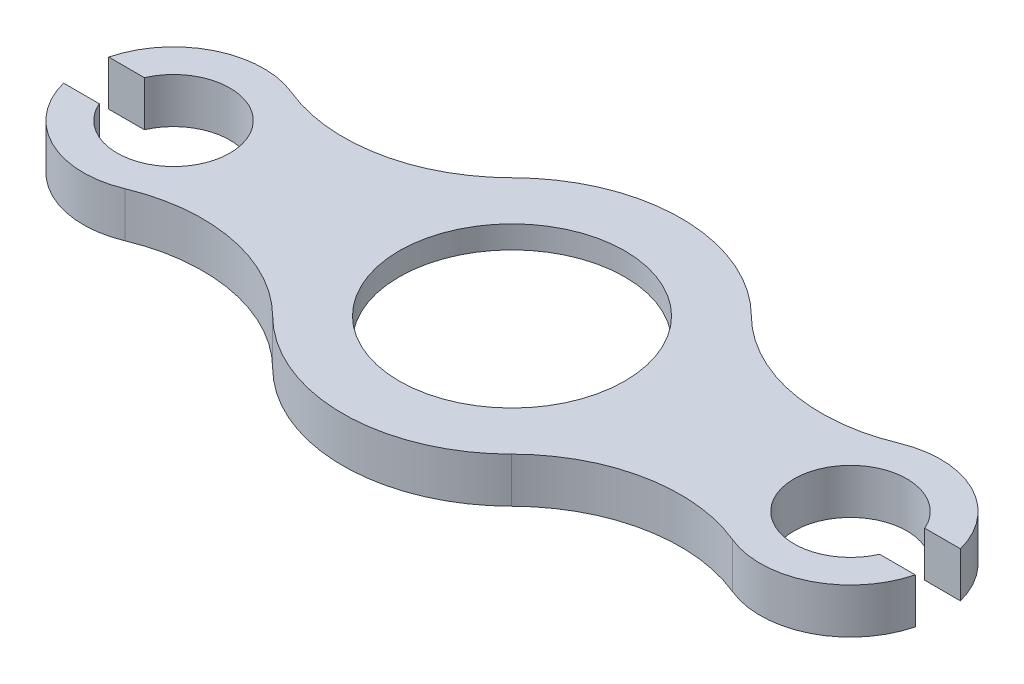
ISO-10303-21;
HEADER;
FILE_DESCRIPTION(('STEP AP214'),'2;1');
FILE_NAME('part.step','',(''),(''),'','','');
FILE_SCHEMA(('AUTOMOTIVE_DESIGN { 1 0 10303 214 1 1 1 1 }'));
ENDSEC;
DATA;
#1=APPLICATION_CONTEXT('core data for automotive mechanical design processes');
#2=APPLICATION_PROTOCOL_DEFINITION('international standard','automotive_design',2000,#1);
#3=PRODUCT_CONTEXT('',#1,'mechanical');
#4=PRODUCT('Part','Part','',(#3));
#5=PRODUCT_RELATED_PRODUCT_CATEGORY('part','',(#4));
#6=PRODUCT_DEFINITION_FORMATION('','',#4);
#7=PRODUCT_DEFINITION_CONTEXT('part definition',#1,'design');
#8=PRODUCT_DEFINITION('design','',#6,#7);
#9=PRODUCT_DEFINITION_SHAPE('','',#8);
#10=(LENGTH_UNIT() NAMED_UNIT(*) SI_UNIT(.MILLI.,.METRE.));
#11=(NAMED_UNIT(*) PLANE_ANGLE_UNIT() SI_UNIT($,.RADIAN.));
#12=(NAMED_UNIT(*) SI_UNIT($,.STERADIAN.) SOLID_ANGLE_UNIT());
#13=UNCERTAINTY_MEASURE_WITH_UNIT(LENGTH_MEASURE(1.E-05),#10,'distance_accuracy_value','');
#14=(GEOMETRIC_REPRESENTATION_CONTEXT(3) GLOBAL_UNCERTAINTY_ASSIGNED_CONTEXT((#13)) GLOBAL_UNIT_ASSIGNED_CONTEXT((#10,
#11,#12)) REPRESENTATION_CONTEXT('',''));
#15=CARTESIAN_POINT('',(0.,0.,0.));
#16=DIRECTION('',(0.,0.,1.));
#17=DIRECTION('',(1.,0.,0.));
#18=AXIS2_PLACEMENT_3D('',#15,#16,#17);
#19=CARTESIAN_POINT('',(17.3076923076924,0.,36.1336032388664));
#20=DIRECTION('',(0.,1.,0.));
#21=DIRECTION('',(0.,0.,1.));
#22=AXIS2_PLACEMENT_3D('',#19,#20,#21);
#23=CYLINDRICAL_SURFACE('',#22,50.);
#24=CARTESIAN_POINT('',(17.3076923076924,20.,36.1336032388664));
#25=DIRECTION('',(0.,1.,0.));
#26=DIRECTION('',(0.,0.,1.));
#27=AXIS2_PLACEMENT_3D('',#24,#25,#26);
#28=CIRCLE('',#27,50.);
#29=CARTESIAN_POINT('',(17.3076923076924,20.,86.1336032388664));
#30=VERTEX_POINT('',#29);
#31=EDGE_CURVE('E211',#30,#30,#28,.T.);
#32=ORIENTED_EDGE('',*,*,#31,.T.);
#33=EDGE_LOOP('',(#32));
#34=FACE_BOUND('',#33,.T.);
#35=CARTESIAN_POINT('',(17.3076923076924,10.,36.1336032388664));
#36=DIRECTION('',(0.,-1.,0.));
#37=DIRECTION('',(0.,0.,-1.));
#38=AXIS2_PLACEMENT_3D('',#35,#36,#37);
#39=CIRCLE('',#38,50.);
#40=CARTESIAN_POINT('',(17.3076923076924,10.,-13.8663967611337));
#41=VERTEX_POINT('',#40);
#42=EDGE_CURVE('E99',#41,#41,#39,.F.);
#43=ORIENTED_EDGE('',*,*,#42,.F.);
#44=EDGE_LOOP('',(#43));
#45=FACE_BOUND('',#44,.T.);
#46=ADVANCED_FACE('F95',(#34,#45),#23,.F.);
#47=CARTESIAN_POINT('',(-132.692307692308,20.,36.1336032388664));
#48=DIRECTION('',(0.,-1.,0.));
#49=DIRECTION('',(0.,0.,-1.));
#50=AXIS2_PLACEMENT_3D('',#47,#48,#49);
#51=CYLINDRICAL_SURFACE('',#50,40.);
#52=CARTESIAN_POINT('',(-132.692307692308,0.,36.1336032388664));
#53=DIRECTION('',(0.,1.,0.));
#54=DIRECTION('',(0.,0.,1.));
#55=AXIS2_PLACEMENT_3D('',#52,#53,#54);
#56=CIRCLE('',#55,40.);
#57=CARTESIAN_POINT('',(-171.422141154382,0.,46.1336032388664));
#58=VERTEX_POINT('',#57);
#59=CARTESIAN_POINT('',(-117.358974358974,0.,73.0780059121928));
#60=VERTEX_POINT('',#59);
#61=EDGE_CURVE('E336',#58,#60,#56,.T.);
#62=ORIENTED_EDGE('',*,*,#61,.T.);
#63=DIRECTION('',(0.,-1.,0.));
#64=VECTOR('',#63,1.);
#65=CARTESIAN_POINT('',(-117.358974358974,20.,73.0780059121928));
#66=LINE('',#65,#64);
#67=CARTESIAN_POINT('',(-117.358974358974,20.,73.0780059121928));
#68=VERTEX_POINT('',#67);
#69=EDGE_CURVE('E106',#68,#60,#66,.T.);
#70=ORIENTED_EDGE('',*,*,#69,.F.);
#71=CARTESIAN_POINT('',(-132.692307692308,20.,36.1336032388664));
#72=DIRECTION('',(0.,1.,0.));
#73=DIRECTION('',(0.,0.,1.));
#74=AXIS2_PLACEMENT_3D('',#71,#72,#73);
#75=CIRCLE('',#74,40.);
#76=CARTESIAN_POINT('',(-171.422141154382,20.,46.1336032388664));
#77=VERTEX_POINT('',#76);
#78=EDGE_CURVE('E399',#77,#68,#75,.T.);
#79=ORIENTED_EDGE('',*,*,#78,.F.);
#80=DIRECTION('',(0.,-1.,0.));
#81=VECTOR('',#80,1.);
#82=CARTESIAN_POINT('',(-171.422141154382,20.,46.1336032388664));
#83=LINE('',#82,#81);
#84=EDGE_CURVE('E12',#77,#58,#83,.T.);
#85=ORIENTED_EDGE('',*,*,#84,.T.);
#86=EDGE_LOOP('',(#62,#70,#79,#85));
#87=FACE_BOUND('',#86,.T.);
#88=ADVANCED_FACE('F425',(#87),#51,.T.);
#89=CARTESIAN_POINT('',(-88.6089743589743,20.,142.34876092468));
#90=DIRECTION('',(0.,-1.,0.));
#91=DIRECTION('',(0.,0.,-1.));
#92=AXIS2_PLACEMENT_3D('',#89,#90,#91);
#93=CYLINDRICAL_SURFACE('',#92,75.);
#94=CARTESIAN_POINT('',(-88.6089743589743,0.,142.34876092468));
#95=DIRECTION('',(0.,1.,0.));
#96=DIRECTION('',(0.,0.,1.));
#97=AXIS2_PLACEMENT_3D('',#94,#95,#96);
#98=CIRCLE('',#97,75.);
#99=CARTESIAN_POINT('',(-35.650641025641,0.,89.2411820817731));
#100=VERTEX_POINT('',#99);
#101=EDGE_CURVE('E340',#100,#60,#98,.T.);
#102=ORIENTED_EDGE('',*,*,#101,.F.);
#103=DIRECTION('',(0.,-1.,0.));
#104=VECTOR('',#103,1.);
#105=CARTESIAN_POINT('',(-35.650641025641,20.,89.2411820817731));
#106=LINE('',#105,#104);
#107=CARTESIAN_POINT('',(-35.650641025641,20.,89.2411820817731));
#108=VERTEX_POINT('',#107);
#109=EDGE_CURVE('E204',#108,#100,#106,.T.);
#110=ORIENTED_EDGE('',*,*,#109,.F.);
#111=CARTESIAN_POINT('',(-88.6089743589743,20.,142.34876092468));
#112=DIRECTION('',(0.,1.,0.));
#113=DIRECTION('',(0.,0.,1.));
#114=AXIS2_PLACEMENT_3D('',#111,#112,#113);
#115=CIRCLE('',#114,75.);
#116=EDGE_CURVE('E289',#108,#68,#115,.T.);
#117=ORIENTED_EDGE('',*,*,#116,.T.);
#118=ORIENTED_EDGE('',*,*,#69,.T.);
#119=EDGE_LOOP('',(#102,#110,#117,#118));
#120=FACE_BOUND('',#119,.T.);
#121=ADVANCED_FACE('F431',(#120),#93,.F.);
#122=CARTESIAN_POINT('',(-88.6089743589743,20.,-70.0815544469471));
#123=DIRECTION('',(0.,-1.,0.));
#124=DIRECTION('',(0.,0.,-1.));
#125=AXIS2_PLACEMENT_3D('',#122,#123,#124);
#126=CYLINDRICAL_SURFACE('',#125,75.);
#127=CARTESIAN_POINT('',(-88.6089743589743,0.,-70.0815544469471));
#128=DIRECTION('',(0.,1.,0.));
#129=DIRECTION('',(0.,0.,1.));
#130=AXIS2_PLACEMENT_3D('',#127,#128,#129);
#131=CIRCLE('',#130,75.);
#132=CARTESIAN_POINT('',(-117.358974358974,0.,-0.810799434460045));
#133=VERTEX_POINT('',#132);
#134=CARTESIAN_POINT('',(-35.650641025641,0.,-16.9739756040404));
#135=VERTEX_POINT('',#134);
#136=EDGE_CURVE('E343',#133,#135,#131,.T.);
#137=ORIENTED_EDGE('',*,*,#136,.F.);
#138=DIRECTION('',(0.,-1.,0.));
#139=VECTOR('',#138,1.);
#140=CARTESIAN_POINT('',(-117.358974358974,20.,-0.810799434460045));
#141=LINE('',#140,#139);
#142=CARTESIAN_POINT('',(-117.358974358974,20.,-0.810799434460045));
#143=VERTEX_POINT('',#142);
#144=EDGE_CURVE('E323',#143,#133,#141,.T.);
#145=ORIENTED_EDGE('',*,*,#144,.F.);
#146=CARTESIAN_POINT('',(-88.6089743589743,20.,-70.0815544469471));
#147=DIRECTION('',(0.,1.,0.));
#148=DIRECTION('',(0.,0.,1.));
#149=AXIS2_PLACEMENT_3D('',#146,#147,#148);
#150=CIRCLE('',#149,75.);
#151=CARTESIAN_POINT('',(-35.650641025641,20.,-16.9739756040404));
#152=VERTEX_POINT('',#151);
#153=EDGE_CURVE('E310',#143,#152,#150,.T.);
#154=ORIENTED_EDGE('',*,*,#153,.T.);
#155=DIRECTION('',(0.,-1.,0.));
#156=VECTOR('',#155,1.);
#157=CARTESIAN_POINT('',(-35.650641025641,20.,-16.9739756040404));
#158=LINE('',#157,#156);
#159=EDGE_CURVE('E362',#152,#135,#158,.T.);
#160=ORIENTED_EDGE('',*,*,#159,.T.);
#161=EDGE_LOOP('',(#137,#145,#154,#160));
#162=FACE_BOUND('',#161,.T.);
#163=ADVANCED_FACE('F396',(#162),#126,.F.);
#164=CARTESIAN_POINT('',(-132.692307692308,20.,36.1336032388664));
#165=DIRECTION('',(0.,-1.,0.));
#166=DIRECTION('',(0.,0.,-1.));
#167=AXIS2_PLACEMENT_3D('',#164,#165,#166);
#168=CYLINDRICAL_SURFACE('',#167,40.);
#169=CARTESIAN_POINT('',(-132.692307692308,0.,36.1336032388664));
#170=DIRECTION('',(0.,1.,0.));
#171=DIRECTION('',(0.,0.,1.));
#172=AXIS2_PLACEMENT_3D('',#169,#170,#171);
#173=CIRCLE('',#172,40.);
#174=CARTESIAN_POINT('',(-171.422141154382,0.,26.1336032388664));
#175=VERTEX_POINT('',#174);
#176=EDGE_CURVE('E318',#133,#175,#173,.T.);
#177=ORIENTED_EDGE('',*,*,#176,.T.);
#178=DIRECTION('',(0.,-1.,0.));
#179=VECTOR('',#178,1.);
#180=CARTESIAN_POINT('',(-171.422141154382,20.,26.1336032388664));
#181=LINE('',#180,#179);
#182=CARTESIAN_POINT('',(-171.422141154382,20.,26.1336032388664));
#183=VERTEX_POINT('',#182);
#184=EDGE_CURVE('E315',#183,#175,#181,.T.);
#185=ORIENTED_EDGE('',*,*,#184,.F.);
#186=CARTESIAN_POINT('',(-132.692307692308,20.,36.1336032388664));
#187=DIRECTION('',(0.,1.,0.));
#188=DIRECTION('',(0.,0.,1.));
#189=AXIS2_PLACEMENT_3D('',#186,#187,#188);
#190=CIRCLE('',#189,40.);
#191=EDGE_CURVE('E303',#143,#183,#190,.T.);
#192=ORIENTED_EDGE('',*,*,#191,.F.);
#193=ORIENTED_EDGE('',*,*,#144,.T.);
#194=EDGE_LOOP('',(#177,#185,#192,#193));
#195=FACE_BOUND('',#194,.T.);
#196=ADVANCED_FACE('F316',(#195),#168,.T.);
#197=CARTESIAN_POINT('',(0.,20.,26.1336032388664));
#198=DIRECTION('',(0.,0.,-1.));
#199=DIRECTION('',(-1.,0.,0.));
#200=AXIS2_PLACEMENT_3D('',#197,#198,#199);
#201=PLANE('',#200);
#202=DIRECTION('',(1.,0.,0.));
#203=VECTOR('',#202,1.);
#204=CARTESIAN_POINT('',(0.,0.,26.1336032388664));
#205=LINE('',#204,#203);
#206=CARTESIAN_POINT('',(-155.605186167087,0.,26.1336032388664));
#207=VERTEX_POINT('',#206);
#208=EDGE_CURVE('E348',#175,#207,#205,.T.);
#209=ORIENTED_EDGE('',*,*,#208,.T.);
#210=DIRECTION('',(0.,-1.,0.));
#211=VECTOR('',#210,1.);
#212=CARTESIAN_POINT('',(-155.605186167087,20.,26.1336032388664));
#213=LINE('',#212,#211);
#214=CARTESIAN_POINT('',(-155.605186167087,20.,26.1336032388664));
#215=VERTEX_POINT('',#214);
#216=EDGE_CURVE('E324',#215,#207,#213,.T.);
#217=ORIENTED_EDGE('',*,*,#216,.F.);
#218=DIRECTION('',(1.,0.,0.));
#219=VECTOR('',#218,1.);
#220=CARTESIAN_POINT('',(0.,20.,26.1336032388664));
#221=LINE('',#220,#219);
#222=EDGE_CURVE('E307',#183,#215,#221,.T.);
#223=ORIENTED_EDGE('',*,*,#222,.F.);
#224=ORIENTED_EDGE('',*,*,#184,.T.);
#225=EDGE_LOOP('',(#209,#217,#223,#224));
#226=FACE_BOUND('',#225,.T.);
#227=ADVANCED_FACE('F326',(#226),#201,.F.);
#228=CARTESIAN_POINT('',(-132.692307692308,20.,36.1336032388664));
#229=DIRECTION('',(0.,-1.,0.));
#230=DIRECTION('',(0.,0.,-1.));
#231=AXIS2_PLACEMENT_3D('',#228,#229,#230);
#232=CYLINDRICAL_SURFACE('',#231,25.);
#233=CARTESIAN_POINT('',(-132.692307692308,0.,36.1336032388664));
#234=DIRECTION('',(0.,1.,0.));
#235=DIRECTION('',(0.,0.,1.));
#236=AXIS2_PLACEMENT_3D('',#233,#234,#235);
#237=CIRCLE('',#236,25.);
#238=CARTESIAN_POINT('',(-155.605186167087,0.,46.1336032388663));
#239=VERTEX_POINT('',#238);
#240=EDGE_CURVE('E351',#239,#207,#237,.T.);
#241=ORIENTED_EDGE('',*,*,#240,.F.);
#242=DIRECTION('',(0.,-1.,0.));
#243=VECTOR('',#242,1.);
#244=CARTESIAN_POINT('',(-155.605186167087,20.,46.1336032388663));
#245=LINE('',#244,#243);
#246=CARTESIAN_POINT('',(-155.605186167087,20.,46.1336032388663));
#247=VERTEX_POINT('',#246);
#248=EDGE_CURVE('E115',#247,#239,#245,.T.);
#249=ORIENTED_EDGE('',*,*,#248,.F.);
#250=CARTESIAN_POINT('',(-132.692307692308,20.,36.1336032388664));
#251=DIRECTION('',(0.,1.,0.));
#252=DIRECTION('',(0.,0.,1.));
#253=AXIS2_PLACEMENT_3D('',#250,#251,#252);
#254=CIRCLE('',#253,25.);
#255=EDGE_CURVE('E328',#247,#215,#254,.T.);
#256=ORIENTED_EDGE('',*,*,#255,.T.);
#257=ORIENTED_EDGE('',*,*,#216,.T.);
#258=EDGE_LOOP('',(#241,#249,#256,#257));
#259=FACE_BOUND('',#258,.T.);
#260=ADVANCED_FACE('F446',(#259),#232,.F.);
#261=CARTESIAN_POINT('',(0.,20.,46.1336032388662));
#262=DIRECTION('',(0.,0.,-1.));
#263=DIRECTION('',(-1.,0.,0.));
#264=AXIS2_PLACEMENT_3D('',#261,#262,#263);
#265=PLANE('',#264);
#266=DIRECTION('',(1.,0.,0.));
#267=VECTOR('',#266,1.);
#268=CARTESIAN_POINT('',(0.,0.,46.1336032388662));
#269=LINE('',#268,#267);
#270=EDGE_CURVE('E277',#58,#239,#269,.T.);
#271=ORIENTED_EDGE('',*,*,#270,.F.);
#272=ORIENTED_EDGE('',*,*,#84,.F.);
#273=DIRECTION('',(1.,0.,0.));
#274=VECTOR('',#273,1.);
#275=CARTESIAN_POINT('',(0.,20.,46.1336032388662));
#276=LINE('',#275,#274);
#277=EDGE_CURVE('E355',#77,#247,#276,.T.);
#278=ORIENTED_EDGE('',*,*,#277,.T.);
#279=ORIENTED_EDGE('',*,*,#248,.T.);
#280=EDGE_LOOP('',(#271,#272,#278,#279));
#281=FACE_BOUND('',#280,.T.);
#282=ADVANCED_FACE('F444',(#281),#265,.T.);
#283=CARTESIAN_POINT('',(0.,0.,0.));
#284=DIRECTION('',(0.,1.,0.));
#285=DIRECTION('',(0.,0.,1.));
#286=AXIS2_PLACEMENT_3D('',#283,#284,#285);
#287=PLANE('',#286);
#288=CARTESIAN_POINT('',(17.3076923076924,0.,36.1336032388664));
#289=DIRECTION('',(0.,-1.,0.));
#290=DIRECTION('',(0.,0.,-1.));
#291=AXIS2_PLACEMENT_3D('',#288,#289,#290);
#292=CIRCLE('',#291,67.8);
#293=CARTESIAN_POINT('',(17.3076923076924,0.,-31.6663967611336));
#294=VERTEX_POINT('',#293);
#295=EDGE_CURVE('E409',#294,#294,#292,.T.);
#296=ORIENTED_EDGE('',*,*,#295,.F.);
#297=EDGE_LOOP('',(#296));
#298=FACE_BOUND('',#297,.T.);
#299=ORIENTED_EDGE('',*,*,#270,.T.);
#300=ORIENTED_EDGE('',*,*,#240,.T.);
#301=ORIENTED_EDGE('',*,*,#208,.F.);
#302=ORIENTED_EDGE('',*,*,#176,.F.);
#303=ORIENTED_EDGE('',*,*,#136,.T.);
#304=CARTESIAN_POINT('',(17.3076923076924,0.,36.1336032388664));
#305=DIRECTION('',(0.,1.,0.));
#306=DIRECTION('',(0.,0.,1.));
#307=AXIS2_PLACEMENT_3D('',#304,#305,#306);
#308=CIRCLE('',#307,75.);
#309=CARTESIAN_POINT('',(70.2660256410257,0.,-16.9739756040404));
#310=VERTEX_POINT('',#309);
#311=EDGE_CURVE('E210',#310,#135,#308,.T.);
#312=ORIENTED_EDGE('',*,*,#311,.F.);
#313=CARTESIAN_POINT('',(123.224358974359,0.,-70.0815544469471));
#314=DIRECTION('',(0.,1.,0.));
#315=DIRECTION('',(0.,0.,1.));
#316=AXIS2_PLACEMENT_3D('',#313,#314,#315);
#317=CIRCLE('',#316,75.);
#318=CARTESIAN_POINT('',(151.974358974359,0.,-0.810799434460066));
#319=VERTEX_POINT('',#318);
#320=EDGE_CURVE('E253',#310,#319,#317,.T.);
#321=ORIENTED_EDGE('',*,*,#320,.T.);
#322=CARTESIAN_POINT('',(167.307692307692,0.,36.1336032388664));
#323=DIRECTION('',(0.,1.,0.));
#324=DIRECTION('',(0.,0.,1.));
#325=AXIS2_PLACEMENT_3D('',#322,#323,#324);
#326=CIRCLE('',#325,40.);
#327=CARTESIAN_POINT('',(206.037525769767,0.,26.1336032388663));
#328=VERTEX_POINT('',#327);
#329=EDGE_CURVE('E249',#328,#319,#326,.T.);
#330=ORIENTED_EDGE('',*,*,#329,.F.);
#331=DIRECTION('',(1.,0.,0.));
#332=VECTOR('',#331,1.);
#333=CARTESIAN_POINT('',(0.,0.,26.1336032388663));
#334=LINE('',#333,#332);
#335=CARTESIAN_POINT('',(190.220570782471,0.,26.1336032388663));
#336=VERTEX_POINT('',#335);
#337=EDGE_CURVE('E246',#336,#328,#334,.T.);
#338=ORIENTED_EDGE('',*,*,#337,.F.);
#339=CARTESIAN_POINT('',(167.307692307692,0.,36.1336032388664));
#340=DIRECTION('',(0.,1.,0.));
#341=DIRECTION('',(0.,0.,1.));
#342=AXIS2_PLACEMENT_3D('',#339,#340,#341);
#343=CIRCLE('',#342,25.);
#344=CARTESIAN_POINT('',(190.220570782472,0.,46.1336032388663));
#345=VERTEX_POINT('',#344);
#346=EDGE_CURVE('E242',#336,#345,#343,.T.);
#347=ORIENTED_EDGE('',*,*,#346,.T.);
#348=DIRECTION('',(1.,0.,0.));
#349=VECTOR('',#348,1.);
#350=CARTESIAN_POINT('',(0.,0.,46.1336032388663));
#351=LINE('',#350,#349);
#352=CARTESIAN_POINT('',(206.037525769767,0.,46.1336032388663));
#353=VERTEX_POINT('',#352);
#354=EDGE_CURVE('E232',#345,#353,#351,.T.);
#355=ORIENTED_EDGE('',*,*,#354,.T.);
#356=CARTESIAN_POINT('',(167.307692307692,0.,36.1336032388664));
#357=DIRECTION('',(0.,1.,0.));
#358=DIRECTION('',(0.,0.,1.));
#359=AXIS2_PLACEMENT_3D('',#356,#357,#358);
#360=CIRCLE('',#359,40.);
#361=CARTESIAN_POINT('',(151.974358974359,0.,73.0780059121928));
#362=VERTEX_POINT('',#361);
#363=EDGE_CURVE('E226',#362,#353,#360,.T.);
#364=ORIENTED_EDGE('',*,*,#363,.F.);
#365=CARTESIAN_POINT('',(123.224358974359,0.,142.34876092468));
#366=DIRECTION('',(0.,1.,0.));
#367=DIRECTION('',(0.,0.,1.));
#368=AXIS2_PLACEMENT_3D('',#365,#366,#367);
#369=CIRCLE('',#368,75.);
#370=CARTESIAN_POINT('',(70.2660256410257,0.,89.2411820817731));
#371=VERTEX_POINT('',#370);
#372=EDGE_CURVE('E215',#362,#371,#369,.T.);
#373=ORIENTED_EDGE('',*,*,#372,.T.);
#374=EDGE_CURVE('E197',#100,#371,#308,.T.);
#375=ORIENTED_EDGE('',*,*,#374,.F.);
#376=ORIENTED_EDGE('',*,*,#101,.T.);
#377=ORIENTED_EDGE('',*,*,#61,.F.);
#378=EDGE_LOOP('',(#299,#300,#301,#302,#303,#312,#321,#330,#338,#347,#355,#364,#373,#375,#376,#377));
#379=FACE_BOUND('',#378,.T.);
#380=ADVANCED_FACE('F223',(#298,#379),#287,.F.);
#381=CARTESIAN_POINT('',(0.,20.,0.));
#382=DIRECTION('',(0.,1.,0.));
#383=DIRECTION('',(0.,0.,1.));
#384=AXIS2_PLACEMENT_3D('',#381,#382,#383);
#385=PLANE('',#384);
#386=ORIENTED_EDGE('',*,*,#31,.F.);
#387=EDGE_LOOP('',(#386));
#388=FACE_BOUND('',#387,.T.);
#389=ORIENTED_EDGE('',*,*,#277,.F.);
#390=ORIENTED_EDGE('',*,*,#78,.T.);
#391=ORIENTED_EDGE('',*,*,#116,.F.);
#392=CARTESIAN_POINT('',(17.3076923076924,20.,36.1336032388664));
#393=DIRECTION('',(0.,1.,0.));
#394=DIRECTION('',(0.,0.,1.));
#395=AXIS2_PLACEMENT_3D('',#392,#393,#394);
#396=CIRCLE('',#395,75.);
#397=CARTESIAN_POINT('',(70.2660256410257,20.,89.2411820817731));
#398=VERTEX_POINT('',#397);
#399=EDGE_CURVE('E235',#108,#398,#396,.T.);
#400=ORIENTED_EDGE('',*,*,#399,.T.);
#401=CARTESIAN_POINT('',(123.224358974359,20.,142.34876092468));
#402=DIRECTION('',(0.,1.,0.));
#403=DIRECTION('',(0.,0.,1.));
#404=AXIS2_PLACEMENT_3D('',#401,#402,#403);
#405=CIRCLE('',#404,75.);
#406=CARTESIAN_POINT('',(151.974358974359,20.,73.0780059121928));
#407=VERTEX_POINT('',#406);
#408=EDGE_CURVE('E217',#407,#398,#405,.T.);
#409=ORIENTED_EDGE('',*,*,#408,.F.);
#410=CARTESIAN_POINT('',(167.307692307692,20.,36.1336032388664));
#411=DIRECTION('',(0.,1.,0.));
#412=DIRECTION('',(0.,0.,1.));
#413=AXIS2_PLACEMENT_3D('',#410,#411,#412);
#414=CIRCLE('',#413,40.);
#415=CARTESIAN_POINT('',(206.037525769767,20.,46.1336032388663));
#416=VERTEX_POINT('',#415);
#417=EDGE_CURVE('E371',#407,#416,#414,.T.);
#418=ORIENTED_EDGE('',*,*,#417,.T.);
#419=DIRECTION('',(1.,0.,0.));
#420=VECTOR('',#419,1.);
#421=CARTESIAN_POINT('',(0.,20.,46.1336032388663));
#422=LINE('',#421,#420);
#423=CARTESIAN_POINT('',(190.220570782472,20.,46.1336032388663));
#424=VERTEX_POINT('',#423);
#425=EDGE_CURVE('E374',#424,#416,#422,.T.);
#426=ORIENTED_EDGE('',*,*,#425,.F.);
#427=CARTESIAN_POINT('',(167.307692307692,20.,36.1336032388664));
#428=DIRECTION('',(0.,1.,0.));
#429=DIRECTION('',(0.,0.,1.));
#430=AXIS2_PLACEMENT_3D('',#427,#428,#429);
#431=CIRCLE('',#430,25.);
#432=CARTESIAN_POINT('',(190.220570782471,20.,26.1336032388663));
#433=VERTEX_POINT('',#432);
#434=EDGE_CURVE('E378',#433,#424,#431,.T.);
#435=ORIENTED_EDGE('',*,*,#434,.F.);
#436=DIRECTION('',(1.,0.,0.));
#437=VECTOR('',#436,1.);
#438=CARTESIAN_POINT('',(0.,20.,26.1336032388663));
#439=LINE('',#438,#437);
#440=CARTESIAN_POINT('',(206.037525769767,20.,26.1336032388663));
#441=VERTEX_POINT('',#440);
#442=EDGE_CURVE('E382',#433,#441,#439,.T.);
#443=ORIENTED_EDGE('',*,*,#442,.T.);
#444=CARTESIAN_POINT('',(167.307692307692,20.,36.1336032388664));
#445=DIRECTION('',(0.,1.,0.));
#446=DIRECTION('',(0.,0.,1.));
#447=AXIS2_PLACEMENT_3D('',#444,#445,#446);
#448=CIRCLE('',#447,40.);
#449=CARTESIAN_POINT('',(151.974358974359,20.,-0.810799434460066));
#450=VERTEX_POINT('',#449);
#451=EDGE_CURVE('E384',#441,#450,#448,.T.);
#452=ORIENTED_EDGE('',*,*,#451,.T.);
#453=CARTESIAN_POINT('',(123.224358974359,20.,-70.0815544469471));
#454=DIRECTION('',(0.,1.,0.));
#455=DIRECTION('',(0.,0.,1.));
#456=AXIS2_PLACEMENT_3D('',#453,#454,#455);
#457=CIRCLE('',#456,75.);
#458=CARTESIAN_POINT('',(70.2660256410257,20.,-16.9739756040404));
#459=VERTEX_POINT('',#458);
#460=EDGE_CURVE('E219',#459,#450,#457,.T.);
#461=ORIENTED_EDGE('',*,*,#460,.F.);
#462=EDGE_CURVE('E228',#459,#152,#396,.T.);
#463=ORIENTED_EDGE('',*,*,#462,.T.);
#464=ORIENTED_EDGE('',*,*,#153,.F.);
#465=ORIENTED_EDGE('',*,*,#191,.T.);
#466=ORIENTED_EDGE('',*,*,#222,.T.);
#467=ORIENTED_EDGE('',*,*,#255,.F.);
#468=EDGE_LOOP('',(#389,#390,#391,#400,#409,#418,#426,#435,#443,#452,#461,#463,#464,#465,#466,#467));
#469=FACE_BOUND('',#468,.T.);
#470=ADVANCED_FACE('F285',(#388,#469),#385,.T.);
#471=CARTESIAN_POINT('',(167.307692307692,20.,36.1336032388664));
#472=DIRECTION('',(0.,-1.,0.));
#473=DIRECTION('',(0.,0.,-1.));
#474=AXIS2_PLACEMENT_3D('',#471,#472,#473);
#475=CYLINDRICAL_SURFACE('',#474,40.);
#476=ORIENTED_EDGE('',*,*,#363,.T.);
#477=DIRECTION('',(0.,-1.,0.));
#478=VECTOR('',#477,1.);
#479=CARTESIAN_POINT('',(206.037525769767,20.,46.1336032388663));
#480=LINE('',#479,#478);
#481=EDGE_CURVE('E272',#416,#353,#480,.T.);
#482=ORIENTED_EDGE('',*,*,#481,.F.);
#483=ORIENTED_EDGE('',*,*,#417,.F.);
#484=DIRECTION('',(0.,-1.,0.));
#485=VECTOR('',#484,1.);
#486=CARTESIAN_POINT('',(151.974358974359,20.,73.0780059121928));
#487=LINE('',#486,#485);
#488=EDGE_CURVE('E275',#407,#362,#487,.T.);
#489=ORIENTED_EDGE('',*,*,#488,.T.);
#490=EDGE_LOOP('',(#476,#482,#483,#489));
#491=FACE_BOUND('',#490,.T.);
#492=ADVANCED_FACE('F440',(#491),#475,.T.);
#493=CARTESIAN_POINT('',(0.,20.,46.1336032388663));
#494=DIRECTION('',(0.,0.,-1.));
#495=DIRECTION('',(-1.,0.,0.));
#496=AXIS2_PLACEMENT_3D('',#493,#494,#495);
#497=PLANE('',#496);
#498=ORIENTED_EDGE('',*,*,#354,.F.);
#499=DIRECTION('',(0.,-1.,0.));
#500=VECTOR('',#499,1.);
#501=CARTESIAN_POINT('',(190.220570782472,20.,46.1336032388663));
#502=LINE('',#501,#500);
#503=EDGE_CURVE('E269',#424,#345,#502,.T.);
#504=ORIENTED_EDGE('',*,*,#503,.F.);
#505=ORIENTED_EDGE('',*,*,#425,.T.);
#506=ORIENTED_EDGE('',*,*,#481,.T.);
#507=EDGE_LOOP('',(#498,#504,#505,#506));
#508=FACE_BOUND('',#507,.T.);
#509=ADVANCED_FACE('F473',(#508),#497,.T.);
#510=CARTESIAN_POINT('',(167.307692307692,20.,36.1336032388664));
#511=DIRECTION('',(0.,-1.,0.));
#512=DIRECTION('',(0.,0.,-1.));
#513=AXIS2_PLACEMENT_3D('',#510,#511,#512);
#514=CYLINDRICAL_SURFACE('',#513,25.);
#515=ORIENTED_EDGE('',*,*,#346,.F.);
#516=DIRECTION('',(0.,-1.,0.));
#517=VECTOR('',#516,1.);
#518=CARTESIAN_POINT('',(190.220570782471,20.,26.1336032388663));
#519=LINE('',#518,#517);
#520=EDGE_CURVE('E266',#433,#336,#519,.T.);
#521=ORIENTED_EDGE('',*,*,#520,.F.);
#522=ORIENTED_EDGE('',*,*,#434,.T.);
#523=ORIENTED_EDGE('',*,*,#503,.T.);
#524=EDGE_LOOP('',(#515,#521,#522,#523));
#525=FACE_BOUND('',#524,.T.);
#526=ADVANCED_FACE('F469',(#525),#514,.F.);
#527=CARTESIAN_POINT('',(0.,20.,26.1336032388663));
#528=DIRECTION('',(0.,0.,-1.));
#529=DIRECTION('',(-1.,0.,0.));
#530=AXIS2_PLACEMENT_3D('',#527,#528,#529);
#531=PLANE('',#530);
#532=ORIENTED_EDGE('',*,*,#337,.T.);
#533=DIRECTION('',(0.,-1.,0.));
#534=VECTOR('',#533,1.);
#535=CARTESIAN_POINT('',(206.037525769767,20.,26.1336032388663));
#536=LINE('',#535,#534);
#537=EDGE_CURVE('E262',#441,#328,#536,.T.);
#538=ORIENTED_EDGE('',*,*,#537,.F.);
#539=ORIENTED_EDGE('',*,*,#442,.F.);
#540=ORIENTED_EDGE('',*,*,#520,.T.);
#541=EDGE_LOOP('',(#532,#538,#539,#540));
#542=FACE_BOUND('',#541,.T.);
#543=ADVANCED_FACE('F465',(#542),#531,.F.);
#544=CARTESIAN_POINT('',(167.307692307692,20.,36.1336032388664));
#545=DIRECTION('',(0.,-1.,0.));
#546=DIRECTION('',(0.,0.,-1.));
#547=AXIS2_PLACEMENT_3D('',#544,#545,#546);
#548=CYLINDRICAL_SURFACE('',#547,40.);
#549=ORIENTED_EDGE('',*,*,#329,.T.);
#550=DIRECTION('',(0.,-1.,0.));
#551=VECTOR('',#550,1.);
#552=CARTESIAN_POINT('',(151.974358974359,20.,-0.810799434460066));
#553=LINE('',#552,#551);
#554=EDGE_CURVE('E259',#450,#319,#553,.T.);
#555=ORIENTED_EDGE('',*,*,#554,.F.);
#556=ORIENTED_EDGE('',*,*,#451,.F.);
#557=ORIENTED_EDGE('',*,*,#537,.T.);
#558=EDGE_LOOP('',(#549,#555,#556,#557));
#559=FACE_BOUND('',#558,.T.);
#560=ADVANCED_FACE('F462',(#559),#548,.T.);
#561=CARTESIAN_POINT('',(123.224358974359,20.,142.34876092468));
#562=DIRECTION('',(0.,-1.,0.));
#563=DIRECTION('',(0.,0.,-1.));
#564=AXIS2_PLACEMENT_3D('',#561,#562,#563);
#565=CYLINDRICAL_SURFACE('',#564,75.);
#566=ORIENTED_EDGE('',*,*,#372,.F.);
#567=ORIENTED_EDGE('',*,*,#488,.F.);
#568=ORIENTED_EDGE('',*,*,#408,.T.);
#569=DIRECTION('',(0.,-1.,0.));
#570=VECTOR('',#569,1.);
#571=CARTESIAN_POINT('',(70.2660256410257,20.,89.2411820817731));
#572=LINE('',#571,#570);
#573=EDGE_CURVE('E201',#398,#371,#572,.T.);
#574=ORIENTED_EDGE('',*,*,#573,.T.);
#575=EDGE_LOOP('',(#566,#567,#568,#574));
#576=FACE_BOUND('',#575,.T.);
#577=ADVANCED_FACE('F214',(#576),#565,.F.);
#578=CARTESIAN_POINT('',(123.224358974359,20.,-70.0815544469471));
#579=DIRECTION('',(0.,-1.,0.));
#580=DIRECTION('',(0.,0.,-1.));
#581=AXIS2_PLACEMENT_3D('',#578,#579,#580);
#582=CYLINDRICAL_SURFACE('',#581,75.);
#583=ORIENTED_EDGE('',*,*,#320,.F.);
#584=DIRECTION('',(0.,-1.,0.));
#585=VECTOR('',#584,1.);
#586=CARTESIAN_POINT('',(70.2660256410257,20.,-16.9739756040404));
#587=LINE('',#586,#585);
#588=EDGE_CURVE('E191',#459,#310,#587,.T.);
#589=ORIENTED_EDGE('',*,*,#588,.F.);
#590=ORIENTED_EDGE('',*,*,#460,.T.);
#591=ORIENTED_EDGE('',*,*,#554,.T.);
#592=EDGE_LOOP('',(#583,#589,#590,#591));
#593=FACE_BOUND('',#592,.T.);
#594=ADVANCED_FACE('F393',(#593),#582,.F.);
#595=CARTESIAN_POINT('',(17.3076923076924,20.,36.1336032388664));
#596=DIRECTION('',(0.,-1.,0.));
#597=DIRECTION('',(0.,0.,-1.));
#598=AXIS2_PLACEMENT_3D('',#595,#596,#597);
#599=CYLINDRICAL_SURFACE('',#598,75.);
#600=ORIENTED_EDGE('',*,*,#159,.F.);
#601=ORIENTED_EDGE('',*,*,#462,.F.);
#602=ORIENTED_EDGE('',*,*,#588,.T.);
#603=ORIENTED_EDGE('',*,*,#311,.T.);
#604=EDGE_LOOP('',(#600,#601,#602,#603));
#605=FACE_BOUND('',#604,.T.);
#606=ADVANCED_FACE('F97',(#605),#599,.T.);
#607=ORIENTED_EDGE('',*,*,#399,.F.);
#608=ORIENTED_EDGE('',*,*,#109,.T.);
#609=ORIENTED_EDGE('',*,*,#374,.T.);
#610=ORIENTED_EDGE('',*,*,#573,.F.);
#611=EDGE_LOOP('',(#607,#608,#609,#610));
#612=FACE_BOUND('',#611,.T.);
#613=ADVANCED_FACE('F200',(#612),#599,.T.);
#614=CARTESIAN_POINT('',(17.3076923076924,10.,36.1336032388664));
#615=DIRECTION('',(0.,-1.,0.));
#616=DIRECTION('',(0.,0.,-1.));
#617=AXIS2_PLACEMENT_3D('',#614,#615,#616);
#618=PLANE('',#617);
#619=CARTESIAN_POINT('',(17.3076923076924,10.,36.1336032388664));
#620=DIRECTION('',(0.,-1.,0.));
#621=DIRECTION('',(0.,0.,-1.));
#622=AXIS2_PLACEMENT_3D('',#619,#620,#621);
#623=CIRCLE('',#622,67.8);
#624=CARTESIAN_POINT('',(17.3076923076924,10.,-31.6663967611336));
#625=VERTEX_POINT('',#624);
#626=EDGE_CURVE('E413',#625,#625,#623,.T.);
#627=ORIENTED_EDGE('',*,*,#626,.T.);
#628=EDGE_LOOP('',(#627));
#629=FACE_BOUND('',#628,.T.);
#630=ORIENTED_EDGE('',*,*,#42,.T.);
#631=EDGE_LOOP('',(#630));
#632=FACE_BOUND('',#631,.T.);
#633=ADVANCED_FACE('F422',(#629,#632),#618,.T.);
#634=CARTESIAN_POINT('',(17.3076923076924,10.,36.1336032388664));
#635=DIRECTION('',(0.,-1.,0.));
#636=DIRECTION('',(0.,0.,-1.));
#637=AXIS2_PLACEMENT_3D('',#634,#635,#636);
#638=CYLINDRICAL_SURFACE('',#637,67.8);
#639=ORIENTED_EDGE('',*,*,#626,.F.);
#640=EDGE_LOOP('',(#639));
#641=FACE_BOUND('',#640,.T.);
#642=ORIENTED_EDGE('',*,*,#295,.T.);
#643=EDGE_LOOP('',(#642));
#644=FACE_BOUND('',#643,.T.);
#645=ADVANCED_FACE('F436',(#641,#644),#638,.F.);
#646=CLOSED_SHELL('',(#46,#88,#121,#163,#196,#227,#260,#282,#380,#470,#492,#509,#526,#543,#560,
#577,#594,#606,#613,#633,#645));
#647=MANIFOLD_SOLID_BREP('B2',#646);
#648=ADVANCED_BREP_SHAPE_REPRESENTATION('',(#18,#647),#14);
#649=SHAPE_DEFINITION_REPRESENTATION(#9,#648);
ENDSEC;
END-ISO-10303-21;
